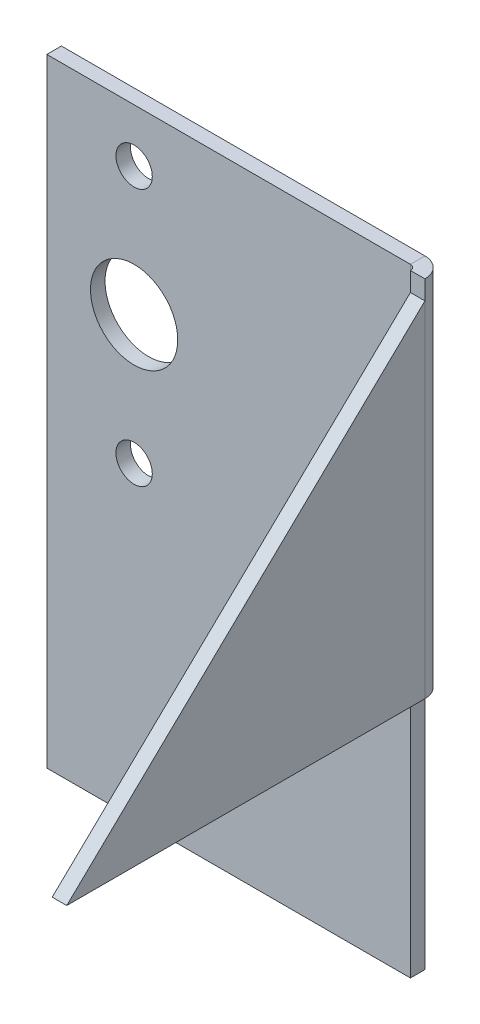
ISO-10303-21;
HEADER;
FILE_DESCRIPTION(('STEP AP214'),'2;1');
FILE_NAME('part.step','',(''),(''),'','','');
FILE_SCHEMA(('AUTOMOTIVE_DESIGN { 1 0 10303 214 1 1 1 1 }'));
ENDSEC;
DATA;
#1=APPLICATION_CONTEXT('core data for automotive mechanical design processes');
#2=APPLICATION_PROTOCOL_DEFINITION('international standard','automotive_design',2000,#1);
#3=PRODUCT_CONTEXT('',#1,'mechanical');
#4=PRODUCT('Part','Part','',(#3));
#5=PRODUCT_RELATED_PRODUCT_CATEGORY('part','',(#4));
#6=PRODUCT_DEFINITION_FORMATION('','',#4);
#7=PRODUCT_DEFINITION_CONTEXT('part definition',#1,'design');
#8=PRODUCT_DEFINITION('design','',#6,#7);
#9=PRODUCT_DEFINITION_SHAPE('','',#8);
#10=(LENGTH_UNIT() NAMED_UNIT(*) SI_UNIT(.MILLI.,.METRE.));
#11=(NAMED_UNIT(*) PLANE_ANGLE_UNIT() SI_UNIT($,.RADIAN.));
#12=(NAMED_UNIT(*) SI_UNIT($,.STERADIAN.) SOLID_ANGLE_UNIT());
#13=UNCERTAINTY_MEASURE_WITH_UNIT(LENGTH_MEASURE(1.E-05),#10,'distance_accuracy_value','');
#14=(GEOMETRIC_REPRESENTATION_CONTEXT(3) GLOBAL_UNCERTAINTY_ASSIGNED_CONTEXT((#13)) GLOBAL_UNIT_ASSIGNED_CONTEXT((#10,
#11,#12)) REPRESENTATION_CONTEXT('',''));
#15=CARTESIAN_POINT('',(0.,0.,0.));
#16=DIRECTION('',(0.,0.,1.));
#17=DIRECTION('',(1.,0.,0.));
#18=AXIS2_PLACEMENT_3D('',#15,#16,#17);
#19=CARTESIAN_POINT('',(-25.,-42.5,-2.));
#20=DIRECTION('',(-1.,0.,0.));
#21=DIRECTION('',(0.,0.,1.));
#22=AXIS2_PLACEMENT_3D('',#19,#20,#21);
#23=PLANE('',#22);
#24=DIRECTION('',(0.,-1.,0.));
#25=VECTOR('',#24,1.);
#26=CARTESIAN_POINT('',(-25.,-42.5,0.));
#27=LINE('',#26,#25);
#28=CARTESIAN_POINT('',(-25.,42.5,0.));
#29=VERTEX_POINT('',#28);
#30=CARTESIAN_POINT('',(-25.,-42.5,0.));
#31=VERTEX_POINT('',#30);
#32=EDGE_CURVE('E189',#29,#31,#27,.T.);
#33=ORIENTED_EDGE('',*,*,#32,.F.);
#34=DIRECTION('',(0.,0.,1.));
#35=VECTOR('',#34,1.);
#36=CARTESIAN_POINT('',(-25.,42.5,-2.));
#37=LINE('',#36,#35);
#38=CARTESIAN_POINT('',(-25.,42.5,-2.));
#39=VERTEX_POINT('',#38);
#40=EDGE_CURVE('E180',#39,#29,#37,.T.);
#41=ORIENTED_EDGE('',*,*,#40,.F.);
#42=DIRECTION('',(0.,-1.,0.));
#43=VECTOR('',#42,1.);
#44=CARTESIAN_POINT('',(-25.,-42.5,-2.));
#45=LINE('',#44,#43);
#46=CARTESIAN_POINT('',(-25.,-42.5,-2.));
#47=VERTEX_POINT('',#46);
#48=EDGE_CURVE('E203',#39,#47,#45,.T.);
#49=ORIENTED_EDGE('',*,*,#48,.T.);
#50=DIRECTION('',(0.,0.,1.));
#51=VECTOR('',#50,1.);
#52=CARTESIAN_POINT('',(-25.,-42.5,-2.));
#53=LINE('',#52,#51);
#54=EDGE_CURVE('E201',#47,#31,#53,.T.);
#55=ORIENTED_EDGE('',*,*,#54,.T.);
#56=EDGE_LOOP('',(#33,#41,#49,#55));
#57=FACE_BOUND('',#56,.T.);
#58=ADVANCED_FACE('F56',(#57),#23,.T.);
#59=CARTESIAN_POINT('',(0.,0.,-2.));
#60=DIRECTION('',(0.,0.,-1.));
#61=DIRECTION('',(-1.,0.,0.));
#62=AXIS2_PLACEMENT_3D('',#59,#60,#61);
#63=PLANE('',#62);
#64=CARTESIAN_POINT('',(-13.,-0.20000000000002,-2.));
#65=DIRECTION('',(0.,0.,1.));
#66=DIRECTION('',(1.,0.,0.));
#67=AXIS2_PLACEMENT_3D('',#64,#65,#66);
#68=CIRCLE('',#67,2.5);
#69=CARTESIAN_POINT('',(-10.5,-0.20000000000002,-2.));
#70=VERTEX_POINT('',#69);
#71=EDGE_CURVE('E277',#70,#70,#68,.T.);
#72=ORIENTED_EDGE('',*,*,#71,.T.);
#73=EDGE_LOOP('',(#72));
#74=FACE_BOUND('',#73,.T.);
#75=CARTESIAN_POINT('',(-13.,17.5,-2.));
#76=DIRECTION('',(0.,0.,1.));
#77=DIRECTION('',(1.,0.,0.));
#78=AXIS2_PLACEMENT_3D('',#75,#76,#77);
#79=CIRCLE('',#78,6.);
#80=CARTESIAN_POINT('',(-7.00000000000001,17.5,-2.));
#81=VERTEX_POINT('',#80);
#82=EDGE_CURVE('E280',#81,#81,#79,.T.);
#83=ORIENTED_EDGE('',*,*,#82,.T.);
#84=EDGE_LOOP('',(#83));
#85=FACE_BOUND('',#84,.T.);
#86=CARTESIAN_POINT('',(-13.,35.2,-2.));
#87=DIRECTION('',(0.,0.,1.));
#88=DIRECTION('',(1.,0.,0.));
#89=AXIS2_PLACEMENT_3D('',#86,#87,#88);
#90=CIRCLE('',#89,2.5);
#91=CARTESIAN_POINT('',(-10.5,35.2,-2.));
#92=VERTEX_POINT('',#91);
#93=EDGE_CURVE('E162',#92,#92,#90,.T.);
#94=ORIENTED_EDGE('',*,*,#93,.T.);
#95=EDGE_LOOP('',(#94));
#96=FACE_BOUND('',#95,.T.);
#97=DIRECTION('',(0.,1.,0.));
#98=VECTOR('',#97,1.);
#99=CARTESIAN_POINT('',(25.,-42.5,-2.));
#100=LINE('',#99,#98);
#101=CARTESIAN_POINT('',(25.,-42.5,-2.));
#102=VERTEX_POINT('',#101);
#103=CARTESIAN_POINT('',(25.,-7.50000000000001,-2.));
#104=VERTEX_POINT('',#103);
#105=EDGE_CURVE('E179',#102,#104,#100,.T.);
#106=ORIENTED_EDGE('',*,*,#105,.F.);
#107=DIRECTION('',(1.,0.,0.));
#108=VECTOR('',#107,1.);
#109=CARTESIAN_POINT('',(-25.,-42.5,-2.));
#110=LINE('',#109,#108);
#111=EDGE_CURVE('E198',#47,#102,#110,.T.);
#112=ORIENTED_EDGE('',*,*,#111,.F.);
#113=ORIENTED_EDGE('',*,*,#48,.F.);
#114=DIRECTION('',(-1.,0.,0.));
#115=VECTOR('',#114,1.);
#116=CARTESIAN_POINT('',(-25.,42.5,-2.));
#117=LINE('',#116,#115);
#118=CARTESIAN_POINT('',(25.,42.5,-2.));
#119=VERTEX_POINT('',#118);
#120=EDGE_CURVE('E183',#119,#39,#117,.T.);
#121=ORIENTED_EDGE('',*,*,#120,.F.);
#122=DIRECTION('',(0.,1.,0.));
#123=VECTOR('',#122,1.);
#124=CARTESIAN_POINT('',(25.,-42.5,-2.));
#125=LINE('',#124,#123);
#126=EDGE_CURVE('E182',#104,#119,#125,.T.);
#127=ORIENTED_EDGE('',*,*,#126,.F.);
#128=EDGE_LOOP('',(#106,#112,#113,#121,#127));
#129=FACE_BOUND('',#128,.T.);
#130=ADVANCED_FACE('F218',(#74,#85,#96,#129),#63,.T.);
#131=CARTESIAN_POINT('',(-25.,-42.5,-2.));
#132=DIRECTION('',(0.,-1.,0.));
#133=DIRECTION('',(0.,0.,-1.));
#134=AXIS2_PLACEMENT_3D('',#131,#132,#133);
#135=PLANE('',#134);
#136=DIRECTION('',(1.,0.,0.));
#137=VECTOR('',#136,1.);
#138=CARTESIAN_POINT('',(-25.,-42.5,0.));
#139=LINE('',#138,#137);
#140=CARTESIAN_POINT('',(25.,-42.5,0.));
#141=VERTEX_POINT('',#140);
#142=EDGE_CURVE('E186',#31,#141,#139,.T.);
#143=ORIENTED_EDGE('',*,*,#142,.F.);
#144=ORIENTED_EDGE('',*,*,#54,.F.);
#145=ORIENTED_EDGE('',*,*,#111,.T.);
#146=DIRECTION('',(0.,0.,1.));
#147=VECTOR('',#146,1.);
#148=CARTESIAN_POINT('',(25.,-42.5,-2.));
#149=LINE('',#148,#147);
#150=EDGE_CURVE('E195',#102,#141,#149,.T.);
#151=ORIENTED_EDGE('',*,*,#150,.T.);
#152=EDGE_LOOP('',(#143,#144,#145,#151));
#153=FACE_BOUND('',#152,.T.);
#154=ADVANCED_FACE('F243',(#153),#135,.T.);
#155=CARTESIAN_POINT('',(0.,0.,0.));
#156=DIRECTION('',(0.,0.,-1.));
#157=DIRECTION('',(-1.,0.,0.));
#158=AXIS2_PLACEMENT_3D('',#155,#156,#157);
#159=PLANE('',#158);
#160=CARTESIAN_POINT('',(-13.,-0.20000000000002,0.));
#161=DIRECTION('',(0.,0.,1.));
#162=DIRECTION('',(1.,0.,0.));
#163=AXIS2_PLACEMENT_3D('',#160,#161,#162);
#164=CIRCLE('',#163,2.5);
#165=CARTESIAN_POINT('',(-10.5,-0.20000000000002,0.));
#166=VERTEX_POINT('',#165);
#167=EDGE_CURVE('E265',#166,#166,#164,.T.);
#168=ORIENTED_EDGE('',*,*,#167,.F.);
#169=EDGE_LOOP('',(#168));
#170=FACE_BOUND('',#169,.T.);
#171=CARTESIAN_POINT('',(-13.,17.5,0.));
#172=DIRECTION('',(0.,0.,1.));
#173=DIRECTION('',(1.,0.,0.));
#174=AXIS2_PLACEMENT_3D('',#171,#172,#173);
#175=CIRCLE('',#174,6.);
#176=CARTESIAN_POINT('',(-7.00000000000001,17.5,0.));
#177=VERTEX_POINT('',#176);
#178=EDGE_CURVE('E269',#177,#177,#175,.T.);
#179=ORIENTED_EDGE('',*,*,#178,.F.);
#180=EDGE_LOOP('',(#179));
#181=FACE_BOUND('',#180,.T.);
#182=CARTESIAN_POINT('',(-13.,35.2,0.));
#183=DIRECTION('',(0.,0.,1.));
#184=DIRECTION('',(1.,0.,0.));
#185=AXIS2_PLACEMENT_3D('',#182,#183,#184);
#186=CIRCLE('',#185,2.5);
#187=CARTESIAN_POINT('',(-10.5,35.2,0.));
#188=VERTEX_POINT('',#187);
#189=EDGE_CURVE('E272',#188,#188,#186,.T.);
#190=ORIENTED_EDGE('',*,*,#189,.F.);
#191=EDGE_LOOP('',(#190));
#192=FACE_BOUND('',#191,.T.);
#193=DIRECTION('',(0.,1.,0.));
#194=VECTOR('',#193,1.);
#195=CARTESIAN_POINT('',(25.,-42.5,0.));
#196=LINE('',#195,#194);
#197=CARTESIAN_POINT('',(25.,-7.50000000000001,0.));
#198=VERTEX_POINT('',#197);
#199=EDGE_CURVE('E60',#141,#198,#196,.T.);
#200=ORIENTED_EDGE('',*,*,#199,.T.);
#201=DIRECTION('',(0.,1.,0.));
#202=VECTOR('',#201,1.);
#203=CARTESIAN_POINT('',(25.,-42.5,0.));
#204=LINE('',#203,#202);
#205=CARTESIAN_POINT('',(25.,42.5,0.));
#206=VERTEX_POINT('',#205);
#207=EDGE_CURVE('E65',#198,#206,#204,.T.);
#208=ORIENTED_EDGE('',*,*,#207,.T.);
#209=DIRECTION('',(-1.,0.,0.));
#210=VECTOR('',#209,1.);
#211=CARTESIAN_POINT('',(-25.,42.5,0.));
#212=LINE('',#211,#210);
#213=EDGE_CURVE('E192',#206,#29,#212,.T.);
#214=ORIENTED_EDGE('',*,*,#213,.T.);
#215=ORIENTED_EDGE('',*,*,#32,.T.);
#216=ORIENTED_EDGE('',*,*,#142,.T.);
#217=EDGE_LOOP('',(#200,#208,#214,#215,#216));
#218=FACE_BOUND('',#217,.T.);
#219=ADVANCED_FACE('F239',(#170,#181,#192,#218),#159,.F.);
#220=CARTESIAN_POINT('',(-25.,42.5,-2.));
#221=DIRECTION('',(0.,1.,0.));
#222=DIRECTION('',(0.,0.,1.));
#223=AXIS2_PLACEMENT_3D('',#220,#221,#222);
#224=PLANE('',#223);
#225=ORIENTED_EDGE('',*,*,#213,.F.);
#226=DIRECTION('',(0.,0.,1.));
#227=VECTOR('',#226,1.);
#228=CARTESIAN_POINT('',(25.,42.5,-2.));
#229=LINE('',#228,#227);
#230=EDGE_CURVE('E207',#119,#206,#229,.T.);
#231=ORIENTED_EDGE('',*,*,#230,.F.);
#232=ORIENTED_EDGE('',*,*,#120,.T.);
#233=ORIENTED_EDGE('',*,*,#40,.T.);
#234=EDGE_LOOP('',(#225,#231,#232,#233));
#235=FACE_BOUND('',#234,.T.);
#236=ADVANCED_FACE('F58',(#235),#224,.T.);
#237=CARTESIAN_POINT('',(25.,0.,-2.));
#238=DIRECTION('',(1.,0.,0.));
#239=DIRECTION('',(0.,0.,-1.));
#240=AXIS2_PLACEMENT_3D('',#237,#238,#239);
#241=PLANE('',#240);
#242=ORIENTED_EDGE('',*,*,#199,.F.);
#243=ORIENTED_EDGE('',*,*,#150,.F.);
#244=ORIENTED_EDGE('',*,*,#105,.T.);
#245=DIRECTION('',(0.,0.,1.));
#246=VECTOR('',#245,1.);
#247=CARTESIAN_POINT('',(25.,-7.50000000000001,-2.));
#248=LINE('',#247,#246);
#249=EDGE_CURVE('E13',#104,#198,#248,.T.);
#250=ORIENTED_EDGE('',*,*,#249,.T.);
#251=EDGE_LOOP('',(#242,#243,#244,#250));
#252=FACE_BOUND('',#251,.T.);
#253=ADVANCED_FACE('F214',(#252),#241,.T.);
#254=CARTESIAN_POINT('',(25.,-7.50000000000001,0.7366));
#255=DIRECTION('',(0.,-1.,0.));
#256=DIRECTION('',(0.,0.,-1.));
#257=AXIS2_PLACEMENT_3D('',#254,#255,#256);
#258=PLANE('',#257);
#259=DIRECTION('',(-1.,0.,0.));
#260=VECTOR('',#259,1.);
#261=CARTESIAN_POINT('',(27.7366,-7.50000000000001,0.736600000000011));
#262=LINE('',#261,#260);
#263=CARTESIAN_POINT('',(27.7366,-7.50000000000001,0.73659999999999));
#264=VERTEX_POINT('',#263);
#265=CARTESIAN_POINT('',(25.7366,-7.50000000000001,0.736600000000003));
#266=VERTEX_POINT('',#265);
#267=EDGE_CURVE('E158',#264,#266,#262,.T.);
#268=ORIENTED_EDGE('',*,*,#267,.T.);
#269=CARTESIAN_POINT('',(25.,-7.50000000000001,0.7366));
#270=DIRECTION('',(0.,-1.,0.));
#271=DIRECTION('',(0.,0.,-1.));
#272=AXIS2_PLACEMENT_3D('',#269,#270,#271);
#273=CIRCLE('',#272,0.7366);
#274=EDGE_CURVE('E81',#266,#198,#273,.F.);
#275=ORIENTED_EDGE('',*,*,#274,.T.);
#276=ORIENTED_EDGE('',*,*,#249,.F.);
#277=CARTESIAN_POINT('',(25.,-7.50000000000001,0.7366));
#278=DIRECTION('',(0.,1.,0.));
#279=DIRECTION('',(0.,0.,1.));
#280=AXIS2_PLACEMENT_3D('',#277,#278,#279);
#281=CIRCLE('',#280,2.7366);
#282=EDGE_CURVE('E163',#264,#104,#281,.T.);
#283=ORIENTED_EDGE('',*,*,#282,.F.);
#284=EDGE_LOOP('',(#268,#275,#276,#283));
#285=FACE_BOUND('',#284,.T.);
#286=ADVANCED_FACE('F233',(#285),#258,.T.);
#287=CARTESIAN_POINT('',(25.,42.5,0.7366));
#288=DIRECTION('',(0.,1.,0.));
#289=DIRECTION('',(0.,0.,1.));
#290=AXIS2_PLACEMENT_3D('',#287,#288,#289);
#291=PLANE('',#290);
#292=ORIENTED_EDGE('',*,*,#230,.T.);
#293=CARTESIAN_POINT('',(25.,42.5,0.7366));
#294=DIRECTION('',(0.,-1.,0.));
#295=DIRECTION('',(0.,0.,-1.));
#296=AXIS2_PLACEMENT_3D('',#293,#294,#295);
#297=CIRCLE('',#296,0.7366);
#298=CARTESIAN_POINT('',(25.7366,42.5,0.736600000000003));
#299=VERTEX_POINT('',#298);
#300=EDGE_CURVE('E173',#206,#299,#297,.T.);
#301=ORIENTED_EDGE('',*,*,#300,.T.);
#302=DIRECTION('',(1.,0.,0.));
#303=VECTOR('',#302,1.);
#304=CARTESIAN_POINT('',(27.7366,42.5,0.736600000000029));
#305=LINE('',#304,#303);
#306=CARTESIAN_POINT('',(27.7366,42.5,0.736600000000029));
#307=VERTEX_POINT('',#306);
#308=EDGE_CURVE('E172',#299,#307,#305,.T.);
#309=ORIENTED_EDGE('',*,*,#308,.T.);
#310=CARTESIAN_POINT('',(25.,42.5,0.7366));
#311=DIRECTION('',(0.,-1.,0.));
#312=DIRECTION('',(0.,0.,-1.));
#313=AXIS2_PLACEMENT_3D('',#310,#311,#312);
#314=CIRCLE('',#313,2.7366);
#315=EDGE_CURVE('E166',#119,#307,#314,.T.);
#316=ORIENTED_EDGE('',*,*,#315,.F.);
#317=EDGE_LOOP('',(#292,#301,#309,#316));
#318=FACE_BOUND('',#317,.T.);
#319=ADVANCED_FACE('F226',(#318),#291,.T.);
#320=CARTESIAN_POINT('',(27.7366,17.5,0.73660000000001));
#321=DIRECTION('',(0.,0.,1.));
#322=DIRECTION('',(0.,-1.,0.));
#323=AXIS2_PLACEMENT_3D('',#320,#321,#322);
#324=PLANE('',#323);
#325=DIRECTION('',(-1.,0.,0.));
#326=VECTOR('',#325,1.);
#327=CARTESIAN_POINT('',(27.7366,39.876630520869,0.736600000000035));
#328=LINE('',#327,#326);
#329=CARTESIAN_POINT('',(27.7366,39.876630520869,0.736600000000027));
#330=VERTEX_POINT('',#329);
#331=CARTESIAN_POINT('',(25.7366,39.876630520869,0.736600000000028));
#332=VERTEX_POINT('',#331);
#333=EDGE_CURVE('E73',#330,#332,#328,.T.);
#334=ORIENTED_EDGE('',*,*,#333,.F.);
#335=DIRECTION('',(0.,-1.,0.));
#336=VECTOR('',#335,1.);
#337=CARTESIAN_POINT('',(27.7366,42.5,0.736600000000029));
#338=LINE('',#337,#336);
#339=EDGE_CURVE('E170',#307,#330,#338,.T.);
#340=ORIENTED_EDGE('',*,*,#339,.F.);
#341=ORIENTED_EDGE('',*,*,#308,.F.);
#342=DIRECTION('',(0.,-1.,0.));
#343=VECTOR('',#342,1.);
#344=CARTESIAN_POINT('',(25.7366,67.6142807770851,0.736600000000003));
#345=LINE('',#344,#343);
#346=EDGE_CURVE('E167',#299,#332,#345,.T.);
#347=ORIENTED_EDGE('',*,*,#346,.T.);
#348=EDGE_LOOP('',(#334,#340,#341,#347));
#349=FACE_BOUND('',#348,.T.);
#350=ADVANCED_FACE('F229',(#349),#324,.T.);
#351=CARTESIAN_POINT('',(25.,67.6142807770851,0.7366));
#352=DIRECTION('',(0.,-1.,0.));
#353=DIRECTION('',(0.,0.,-1.));
#354=AXIS2_PLACEMENT_3D('',#351,#352,#353);
#355=CYLINDRICAL_SURFACE('',#354,2.7366);
#356=ORIENTED_EDGE('',*,*,#315,.T.);
#357=ORIENTED_EDGE('',*,*,#339,.T.);
#358=DIRECTION('',(0.,-1.,0.));
#359=VECTOR('',#358,1.);
#360=CARTESIAN_POINT('',(27.7366,-42.5,0.736600000000018));
#361=LINE('',#360,#359);
#362=EDGE_CURVE('E160',#330,#264,#361,.T.);
#363=ORIENTED_EDGE('',*,*,#362,.T.);
#364=ORIENTED_EDGE('',*,*,#282,.T.);
#365=ORIENTED_EDGE('',*,*,#126,.T.);
#366=EDGE_LOOP('',(#356,#357,#363,#364,#365));
#367=FACE_BOUND('',#366,.T.);
#368=ADVANCED_FACE('F223',(#367),#355,.T.);
#369=CARTESIAN_POINT('',(25.,67.6142807770851,0.7366));
#370=DIRECTION('',(0.,-1.,0.));
#371=DIRECTION('',(0.,0.,-1.));
#372=AXIS2_PLACEMENT_3D('',#369,#370,#371);
#373=CYLINDRICAL_SURFACE('',#372,0.7366);
#374=ORIENTED_EDGE('',*,*,#300,.F.);
#375=ORIENTED_EDGE('',*,*,#207,.F.);
#376=ORIENTED_EDGE('',*,*,#274,.F.);
#377=DIRECTION('',(0.,1.,0.));
#378=VECTOR('',#377,1.);
#379=CARTESIAN_POINT('',(25.7366,-42.5,0.736600000000025));
#380=LINE('',#379,#378);
#381=EDGE_CURVE('E148',#266,#332,#380,.T.);
#382=ORIENTED_EDGE('',*,*,#381,.T.);
#383=ORIENTED_EDGE('',*,*,#346,.F.);
#384=EDGE_LOOP('',(#374,#375,#376,#382,#383));
#385=FACE_BOUND('',#384,.T.);
#386=ADVANCED_FACE('F235',(#385),#373,.F.);
#387=CARTESIAN_POINT('',(27.7366,0.,0.));
#388=DIRECTION('',(-1.,0.,0.));
#389=DIRECTION('',(0.,0.,1.));
#390=AXIS2_PLACEMENT_3D('',#387,#388,#389);
#391=PLANE('',#390);
#392=DIRECTION('',(0.,-0.693169354814679,0.720774753682315));
#393=VECTOR('',#392,1.);
#394=CARTESIAN_POINT('',(27.7366,34.5699147101136,6.25465522675182));
#395=LINE('',#394,#393);
#396=CARTESIAN_POINT('',(27.7365999999998,-7.50000000000001,50.));
#397=VERTEX_POINT('',#396);
#398=EDGE_CURVE('E153',#330,#397,#395,.T.);
#399=ORIENTED_EDGE('',*,*,#398,.T.);
#400=DIRECTION('',(0.,0.,-1.));
#401=VECTOR('',#400,1.);
#402=CARTESIAN_POINT('',(27.7366000000001,-7.50000000000002,-26.991244901112));
#403=LINE('',#402,#401);
#404=EDGE_CURVE('E137',#397,#264,#403,.T.);
#405=ORIENTED_EDGE('',*,*,#404,.T.);
#406=ORIENTED_EDGE('',*,*,#362,.F.);
#407=EDGE_LOOP('',(#399,#405,#406));
#408=FACE_BOUND('',#407,.T.);
#409=ADVANCED_FACE('F232',(#408),#391,.F.);
#410=CARTESIAN_POINT('',(27.7366,34.5699147101136,6.25465522675182));
#411=DIRECTION('',(0.,-0.720774753682315,-0.693169354814679));
#412=DIRECTION('',(0.,-0.693169354814679,0.720774753682315));
#413=AXIS2_PLACEMENT_3D('',#410,#411,#412);
#414=PLANE('',#413);
#415=DIRECTION('',(0.,-0.693169354814679,0.720774753682315));
#416=VECTOR('',#415,1.);
#417=CARTESIAN_POINT('',(25.7366,34.5699147101136,6.25465522675181));
#418=LINE('',#417,#416);
#419=CARTESIAN_POINT('',(25.7365999999998,-7.50000000000001,50.));
#420=VERTEX_POINT('',#419);
#421=EDGE_CURVE('E146',#332,#420,#418,.T.);
#422=ORIENTED_EDGE('',*,*,#421,.T.);
#423=DIRECTION('',(-1.,0.,0.));
#424=VECTOR('',#423,1.);
#425=CARTESIAN_POINT('',(27.7365999999998,-7.50000000000001,50.));
#426=LINE('',#425,#424);
#427=EDGE_CURVE('E130',#397,#420,#426,.T.);
#428=ORIENTED_EDGE('',*,*,#427,.F.);
#429=ORIENTED_EDGE('',*,*,#398,.F.);
#430=ORIENTED_EDGE('',*,*,#333,.T.);
#431=EDGE_LOOP('',(#422,#428,#429,#430));
#432=FACE_BOUND('',#431,.T.);
#433=ADVANCED_FACE('F150',(#432),#414,.F.);
#434=CARTESIAN_POINT('',(25.7366,0.,0.));
#435=DIRECTION('',(-1.,0.,0.));
#436=DIRECTION('',(0.,0.,1.));
#437=AXIS2_PLACEMENT_3D('',#434,#435,#436);
#438=PLANE('',#437);
#439=DIRECTION('',(0.,0.,-1.));
#440=VECTOR('',#439,1.);
#441=CARTESIAN_POINT('',(25.7366000000001,-7.50000000000002,-26.991244901112));
#442=LINE('',#441,#440);
#443=EDGE_CURVE('E134',#420,#266,#442,.T.);
#444=ORIENTED_EDGE('',*,*,#443,.F.);
#445=ORIENTED_EDGE('',*,*,#421,.F.);
#446=ORIENTED_EDGE('',*,*,#381,.F.);
#447=EDGE_LOOP('',(#444,#445,#446));
#448=FACE_BOUND('',#447,.T.);
#449=ADVANCED_FACE('F145',(#448),#438,.T.);
#450=CARTESIAN_POINT('',(27.7366000000001,-7.50000000000002,-26.991244901112));
#451=DIRECTION('',(0.,1.,0.));
#452=DIRECTION('',(0.,0.,-1.));
#453=AXIS2_PLACEMENT_3D('',#450,#451,#452);
#454=PLANE('',#453);
#455=ORIENTED_EDGE('',*,*,#267,.F.);
#456=ORIENTED_EDGE('',*,*,#404,.F.);
#457=ORIENTED_EDGE('',*,*,#427,.T.);
#458=ORIENTED_EDGE('',*,*,#443,.T.);
#459=EDGE_LOOP('',(#455,#456,#457,#458));
#460=FACE_BOUND('',#459,.T.);
#461=ADVANCED_FACE('F133',(#460),#454,.F.);
#462=CARTESIAN_POINT('',(-13.,35.2,-2.));
#463=DIRECTION('',(0.,0.,1.));
#464=DIRECTION('',(1.,0.,0.));
#465=AXIS2_PLACEMENT_3D('',#462,#463,#464);
#466=CYLINDRICAL_SURFACE('',#465,2.5);
#467=ORIENTED_EDGE('',*,*,#93,.F.);
#468=EDGE_LOOP('',(#467));
#469=FACE_BOUND('',#468,.T.);
#470=ORIENTED_EDGE('',*,*,#189,.T.);
#471=EDGE_LOOP('',(#470));
#472=FACE_BOUND('',#471,.T.);
#473=ADVANCED_FACE('F296',(#469,#472),#466,.F.);
#474=CARTESIAN_POINT('',(-13.,17.5,-2.));
#475=DIRECTION('',(0.,0.,1.));
#476=DIRECTION('',(1.,0.,0.));
#477=AXIS2_PLACEMENT_3D('',#474,#475,#476);
#478=CYLINDRICAL_SURFACE('',#477,6.);
#479=ORIENTED_EDGE('',*,*,#82,.F.);
#480=EDGE_LOOP('',(#479));
#481=FACE_BOUND('',#480,.T.);
#482=ORIENTED_EDGE('',*,*,#178,.T.);
#483=EDGE_LOOP('',(#482));
#484=FACE_BOUND('',#483,.T.);
#485=ADVANCED_FACE('F291',(#481,#484),#478,.F.);
#486=CARTESIAN_POINT('',(-13.,-0.20000000000002,-2.));
#487=DIRECTION('',(0.,0.,1.));
#488=DIRECTION('',(1.,0.,0.));
#489=AXIS2_PLACEMENT_3D('',#486,#487,#488);
#490=CYLINDRICAL_SURFACE('',#489,2.5);
#491=ORIENTED_EDGE('',*,*,#71,.F.);
#492=EDGE_LOOP('',(#491));
#493=FACE_BOUND('',#492,.T.);
#494=ORIENTED_EDGE('',*,*,#167,.T.);
#495=EDGE_LOOP('',(#494));
#496=FACE_BOUND('',#495,.T.);
#497=ADVANCED_FACE('F288',(#493,#496),#490,.F.);
#498=CLOSED_SHELL('',(#58,#130,#154,#219,#236,#253,#286,#319,#350,#368,#386,#409,#433,#449,#461,
#473,#485,#497));
#499=MANIFOLD_SOLID_BREP('B2',#498);
#500=ADVANCED_BREP_SHAPE_REPRESENTATION('',(#18,#499),#14);
#501=SHAPE_DEFINITION_REPRESENTATION(#9,#500);
ENDSEC;
END-ISO-10303-21;
